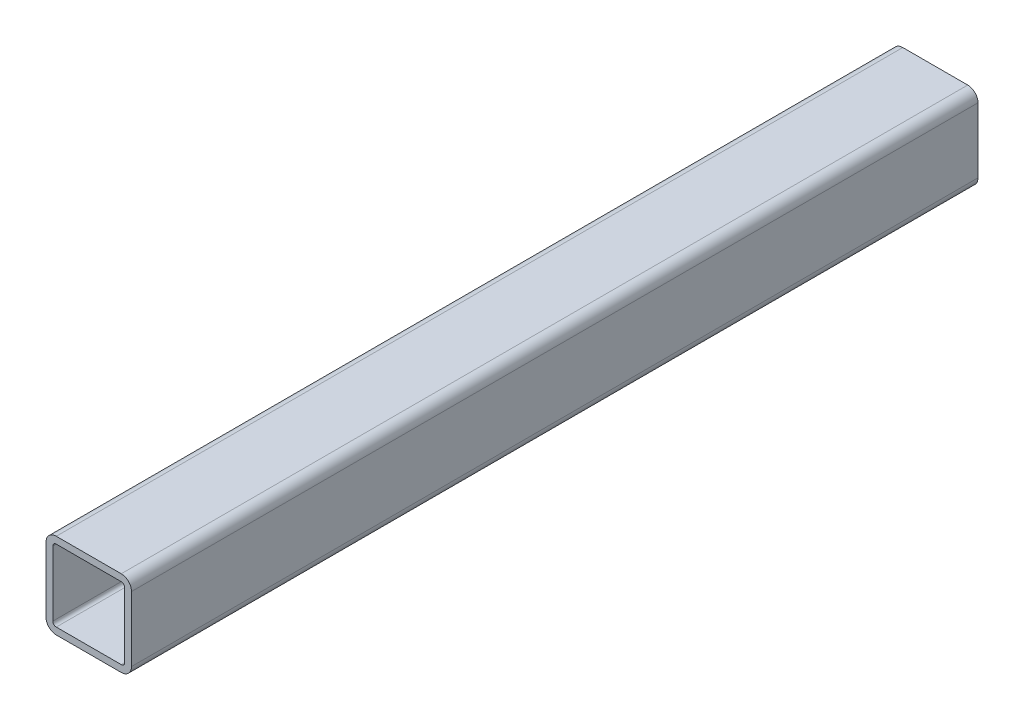
ISO-10303-21;
HEADER;
FILE_DESCRIPTION(('STEP AP214'),'2;1');
FILE_NAME('part.step','',(''),(''),'','','');
FILE_SCHEMA(('AUTOMOTIVE_DESIGN { 1 0 10303 214 1 1 1 1 }'));
ENDSEC;
DATA;
#1=APPLICATION_CONTEXT('core data for automotive mechanical design processes');
#2=APPLICATION_PROTOCOL_DEFINITION('international standard','automotive_design',2000,#1);
#3=PRODUCT_CONTEXT('',#1,'mechanical');
#4=PRODUCT('Part','Part','',(#3));
#5=PRODUCT_RELATED_PRODUCT_CATEGORY('part','',(#4));
#6=PRODUCT_DEFINITION_FORMATION('','',#4);
#7=PRODUCT_DEFINITION_CONTEXT('part definition',#1,'design');
#8=PRODUCT_DEFINITION('design','',#6,#7);
#9=PRODUCT_DEFINITION_SHAPE('','',#8);
#10=(LENGTH_UNIT() NAMED_UNIT(*) SI_UNIT(.MILLI.,.METRE.));
#11=(NAMED_UNIT(*) PLANE_ANGLE_UNIT() SI_UNIT($,.RADIAN.));
#12=(NAMED_UNIT(*) SI_UNIT($,.STERADIAN.) SOLID_ANGLE_UNIT());
#13=UNCERTAINTY_MEASURE_WITH_UNIT(LENGTH_MEASURE(1.E-05),#10,'distance_accuracy_value','');
#14=(GEOMETRIC_REPRESENTATION_CONTEXT(3) GLOBAL_UNCERTAINTY_ASSIGNED_CONTEXT((#13)) GLOBAL_UNIT_ASSIGNED_CONTEXT((#10,
#11,#12)) REPRESENTATION_CONTEXT('',''));
#15=CARTESIAN_POINT('',(0.,0.,0.));
#16=DIRECTION('',(0.,0.,1.));
#17=DIRECTION('',(1.,0.,0.));
#18=AXIS2_PLACEMENT_3D('',#15,#16,#17);
#19=CARTESIAN_POINT('',(0.,0.,247.5));
#20=DIRECTION('',(0.,0.,1.));
#21=DIRECTION('',(1.,0.,0.));
#22=AXIS2_PLACEMENT_3D('',#19,#20,#21);
#23=PLANE('',#22);
#24=DIRECTION('',(0.,1.,0.));
#25=VECTOR('',#24,1.);
#26=CARTESIAN_POINT('',(-12.5,-4.75,247.5));
#27=LINE('',#26,#25);
#28=CARTESIAN_POINT('',(-12.5,-9.5,247.5));
#29=VERTEX_POINT('',#28);
#30=CARTESIAN_POINT('',(-12.5,9.5,247.5));
#31=VERTEX_POINT('',#30);
#32=EDGE_CURVE('E128',#29,#31,#27,.T.);
#33=ORIENTED_EDGE('',*,*,#32,.F.);
#34=CARTESIAN_POINT('',(-9.5,-9.5,247.5));
#35=DIRECTION('',(0.,0.,-1.));
#36=DIRECTION('',(1.,0.,0.));
#37=AXIS2_PLACEMENT_3D('',#34,#35,#36);
#38=CIRCLE('',#37,3.);
#39=CARTESIAN_POINT('',(-9.5,-12.5,247.5));
#40=VERTEX_POINT('',#39);
#41=EDGE_CURVE('E160',#40,#29,#38,.T.);
#42=ORIENTED_EDGE('',*,*,#41,.F.);
#43=DIRECTION('',(-1.,0.,0.));
#44=VECTOR('',#43,1.);
#45=CARTESIAN_POINT('',(4.75,-12.5,247.5));
#46=LINE('',#45,#44);
#47=CARTESIAN_POINT('',(9.5,-12.5,247.5));
#48=VERTEX_POINT('',#47);
#49=EDGE_CURVE('E224',#48,#40,#46,.T.);
#50=ORIENTED_EDGE('',*,*,#49,.F.);
#51=CARTESIAN_POINT('',(9.5,-9.5,247.5));
#52=DIRECTION('',(0.,0.,-1.));
#53=DIRECTION('',(0.,1.,0.));
#54=AXIS2_PLACEMENT_3D('',#51,#52,#53);
#55=CIRCLE('',#54,3.);
#56=CARTESIAN_POINT('',(12.5,-9.5,247.5));
#57=VERTEX_POINT('',#56);
#58=EDGE_CURVE('E242',#57,#48,#55,.T.);
#59=ORIENTED_EDGE('',*,*,#58,.F.);
#60=DIRECTION('',(0.,-1.,0.));
#61=VECTOR('',#60,1.);
#62=CARTESIAN_POINT('',(12.5,4.75,247.5));
#63=LINE('',#62,#61);
#64=CARTESIAN_POINT('',(12.5,9.5,247.5));
#65=VERTEX_POINT('',#64);
#66=EDGE_CURVE('E299',#65,#57,#63,.T.);
#67=ORIENTED_EDGE('',*,*,#66,.F.);
#68=CARTESIAN_POINT('',(9.5,9.5,247.5));
#69=DIRECTION('',(0.,0.,-1.));
#70=DIRECTION('',(-1.,0.,0.));
#71=AXIS2_PLACEMENT_3D('',#68,#69,#70);
#72=CIRCLE('',#71,3.);
#73=CARTESIAN_POINT('',(9.5,12.5,247.5));
#74=VERTEX_POINT('',#73);
#75=EDGE_CURVE('E27',#74,#65,#72,.T.);
#76=ORIENTED_EDGE('',*,*,#75,.F.);
#77=DIRECTION('',(1.,0.,0.));
#78=VECTOR('',#77,1.);
#79=CARTESIAN_POINT('',(-4.75,12.5,247.5));
#80=LINE('',#79,#78);
#81=CARTESIAN_POINT('',(-9.5,12.5,247.5));
#82=VERTEX_POINT('',#81);
#83=EDGE_CURVE('E262',#82,#74,#80,.T.);
#84=ORIENTED_EDGE('',*,*,#83,.F.);
#85=CARTESIAN_POINT('',(-9.5,9.5,247.5));
#86=DIRECTION('',(0.,0.,-1.));
#87=DIRECTION('',(0.,-1.,0.));
#88=AXIS2_PLACEMENT_3D('',#85,#86,#87);
#89=CIRCLE('',#88,3.);
#90=EDGE_CURVE('E258',#31,#82,#89,.T.);
#91=ORIENTED_EDGE('',*,*,#90,.F.);
#92=EDGE_LOOP('',(#33,#42,#50,#59,#67,#76,#84,#91));
#93=FACE_BOUND('',#92,.T.);
#94=DIRECTION('',(-1.,0.,0.));
#95=VECTOR('',#94,1.);
#96=CARTESIAN_POINT('',(-4.75,10.5,247.5));
#97=LINE('',#96,#95);
#98=CARTESIAN_POINT('',(9.5,10.5,247.5));
#99=VERTEX_POINT('',#98);
#100=CARTESIAN_POINT('',(-9.5,10.5,247.5));
#101=VERTEX_POINT('',#100);
#102=EDGE_CURVE('E143',#99,#101,#97,.T.);
#103=ORIENTED_EDGE('',*,*,#102,.F.);
#104=CARTESIAN_POINT('',(9.5,9.5,247.5));
#105=DIRECTION('',(0.,0.,1.));
#106=DIRECTION('',(-1.,0.,0.));
#107=AXIS2_PLACEMENT_3D('',#104,#105,#106);
#108=CIRCLE('',#107,1.);
#109=CARTESIAN_POINT('',(10.5,9.5,247.5));
#110=VERTEX_POINT('',#109);
#111=EDGE_CURVE('E170',#110,#99,#108,.T.);
#112=ORIENTED_EDGE('',*,*,#111,.F.);
#113=DIRECTION('',(0.,1.,0.));
#114=VECTOR('',#113,1.);
#115=CARTESIAN_POINT('',(10.5,4.75,247.5));
#116=LINE('',#115,#114);
#117=CARTESIAN_POINT('',(10.5,-9.5,247.5));
#118=VERTEX_POINT('',#117);
#119=EDGE_CURVE('E169',#118,#110,#116,.T.);
#120=ORIENTED_EDGE('',*,*,#119,.F.);
#121=CARTESIAN_POINT('',(9.5,-9.5,247.5));
#122=DIRECTION('',(0.,0.,1.));
#123=DIRECTION('',(0.,1.,0.));
#124=AXIS2_PLACEMENT_3D('',#121,#122,#123);
#125=CIRCLE('',#124,1.);
#126=CARTESIAN_POINT('',(9.5,-10.5,247.5));
#127=VERTEX_POINT('',#126);
#128=EDGE_CURVE('E180',#127,#118,#125,.T.);
#129=ORIENTED_EDGE('',*,*,#128,.F.);
#130=DIRECTION('',(1.,0.,0.));
#131=VECTOR('',#130,1.);
#132=CARTESIAN_POINT('',(4.75,-10.5,247.5));
#133=LINE('',#132,#131);
#134=CARTESIAN_POINT('',(-9.5,-10.5,247.5));
#135=VERTEX_POINT('',#134);
#136=EDGE_CURVE('E216',#135,#127,#133,.T.);
#137=ORIENTED_EDGE('',*,*,#136,.F.);
#138=CARTESIAN_POINT('',(-9.5,-9.5,247.5));
#139=DIRECTION('',(0.,0.,1.));
#140=DIRECTION('',(1.,0.,0.));
#141=AXIS2_PLACEMENT_3D('',#138,#139,#140);
#142=CIRCLE('',#141,1.);
#143=CARTESIAN_POINT('',(-10.5,-9.5,247.5));
#144=VERTEX_POINT('',#143);
#145=EDGE_CURVE('E140',#144,#135,#142,.T.);
#146=ORIENTED_EDGE('',*,*,#145,.F.);
#147=DIRECTION('',(0.,-1.,0.));
#148=VECTOR('',#147,1.);
#149=CARTESIAN_POINT('',(-10.5,-4.75,247.5));
#150=LINE('',#149,#148);
#151=CARTESIAN_POINT('',(-10.5,9.5,247.5));
#152=VERTEX_POINT('',#151);
#153=EDGE_CURVE('E193',#152,#144,#150,.T.);
#154=ORIENTED_EDGE('',*,*,#153,.F.);
#155=CARTESIAN_POINT('',(-9.5,9.5,247.5));
#156=DIRECTION('',(0.,0.,1.));
#157=DIRECTION('',(0.,-1.,0.));
#158=AXIS2_PLACEMENT_3D('',#155,#156,#157);
#159=CIRCLE('',#158,1.);
#160=EDGE_CURVE('E129',#101,#152,#159,.T.);
#161=ORIENTED_EDGE('',*,*,#160,.F.);
#162=EDGE_LOOP('',(#103,#112,#120,#129,#137,#146,#154,#161));
#163=FACE_BOUND('',#162,.T.);
#164=ADVANCED_FACE('F16',(#93,#163),#23,.T.);
#165=CARTESIAN_POINT('',(0.,0.,0.));
#166=DIRECTION('',(0.,0.,1.));
#167=DIRECTION('',(1.,0.,0.));
#168=AXIS2_PLACEMENT_3D('',#165,#166,#167);
#169=PLANE('',#168);
#170=DIRECTION('',(0.,1.,0.));
#171=VECTOR('',#170,1.);
#172=CARTESIAN_POINT('',(-12.5,-4.75,0.));
#173=LINE('',#172,#171);
#174=CARTESIAN_POINT('',(-12.5,-9.5,0.));
#175=VERTEX_POINT('',#174);
#176=CARTESIAN_POINT('',(-12.5,9.5,0.));
#177=VERTEX_POINT('',#176);
#178=EDGE_CURVE('E20',#175,#177,#173,.T.);
#179=ORIENTED_EDGE('',*,*,#178,.T.);
#180=CARTESIAN_POINT('',(-9.5,9.5,0.));
#181=DIRECTION('',(0.,0.,-1.));
#182=DIRECTION('',(0.,-1.,0.));
#183=AXIS2_PLACEMENT_3D('',#180,#181,#182);
#184=CIRCLE('',#183,3.);
#185=CARTESIAN_POINT('',(-9.5,12.5,0.));
#186=VERTEX_POINT('',#185);
#187=EDGE_CURVE('E257',#177,#186,#184,.T.);
#188=ORIENTED_EDGE('',*,*,#187,.T.);
#189=DIRECTION('',(1.,0.,0.));
#190=VECTOR('',#189,1.);
#191=CARTESIAN_POINT('',(-4.75,12.5,0.));
#192=LINE('',#191,#190);
#193=CARTESIAN_POINT('',(9.5,12.5,0.));
#194=VERTEX_POINT('',#193);
#195=EDGE_CURVE('E163',#186,#194,#192,.T.);
#196=ORIENTED_EDGE('',*,*,#195,.T.);
#197=CARTESIAN_POINT('',(9.5,9.5,0.));
#198=DIRECTION('',(0.,0.,-1.));
#199=DIRECTION('',(-1.,0.,0.));
#200=AXIS2_PLACEMENT_3D('',#197,#198,#199);
#201=CIRCLE('',#200,3.);
#202=CARTESIAN_POINT('',(12.5,9.5,0.));
#203=VERTEX_POINT('',#202);
#204=EDGE_CURVE('E11',#194,#203,#201,.T.);
#205=ORIENTED_EDGE('',*,*,#204,.T.);
#206=DIRECTION('',(0.,-1.,0.));
#207=VECTOR('',#206,1.);
#208=CARTESIAN_POINT('',(12.5,4.75,0.));
#209=LINE('',#208,#207);
#210=CARTESIAN_POINT('',(12.5,-9.5,0.));
#211=VERTEX_POINT('',#210);
#212=EDGE_CURVE('E230',#203,#211,#209,.T.);
#213=ORIENTED_EDGE('',*,*,#212,.T.);
#214=CARTESIAN_POINT('',(9.5,-9.5,0.));
#215=DIRECTION('',(0.,0.,-1.));
#216=DIRECTION('',(0.,1.,0.));
#217=AXIS2_PLACEMENT_3D('',#214,#215,#216);
#218=CIRCLE('',#217,3.);
#219=CARTESIAN_POINT('',(9.5,-12.5,0.));
#220=VERTEX_POINT('',#219);
#221=EDGE_CURVE('E229',#211,#220,#218,.T.);
#222=ORIENTED_EDGE('',*,*,#221,.T.);
#223=DIRECTION('',(-1.,0.,0.));
#224=VECTOR('',#223,1.);
#225=CARTESIAN_POINT('',(4.75,-12.5,0.));
#226=LINE('',#225,#224);
#227=CARTESIAN_POINT('',(-9.5,-12.5,0.));
#228=VERTEX_POINT('',#227);
#229=EDGE_CURVE('E241',#220,#228,#226,.T.);
#230=ORIENTED_EDGE('',*,*,#229,.T.);
#231=CARTESIAN_POINT('',(-9.5,-9.5,0.));
#232=DIRECTION('',(0.,0.,-1.));
#233=DIRECTION('',(1.,0.,0.));
#234=AXIS2_PLACEMENT_3D('',#231,#232,#233);
#235=CIRCLE('',#234,3.);
#236=EDGE_CURVE('E150',#228,#175,#235,.T.);
#237=ORIENTED_EDGE('',*,*,#236,.T.);
#238=EDGE_LOOP('',(#179,#188,#196,#205,#213,#222,#230,#237));
#239=FACE_BOUND('',#238,.T.);
#240=DIRECTION('',(-1.,0.,0.));
#241=VECTOR('',#240,1.);
#242=CARTESIAN_POINT('',(-4.75,10.5,0.));
#243=LINE('',#242,#241);
#244=CARTESIAN_POINT('',(9.5,10.5,0.));
#245=VERTEX_POINT('',#244);
#246=CARTESIAN_POINT('',(-9.5,10.5,0.));
#247=VERTEX_POINT('',#246);
#248=EDGE_CURVE('E132',#245,#247,#243,.T.);
#249=ORIENTED_EDGE('',*,*,#248,.T.);
#250=CARTESIAN_POINT('',(-9.5,9.5,0.));
#251=DIRECTION('',(0.,0.,1.));
#252=DIRECTION('',(0.,-1.,0.));
#253=AXIS2_PLACEMENT_3D('',#250,#251,#252);
#254=CIRCLE('',#253,1.);
#255=CARTESIAN_POINT('',(-10.5,9.5,0.));
#256=VERTEX_POINT('',#255);
#257=EDGE_CURVE('E115',#247,#256,#254,.T.);
#258=ORIENTED_EDGE('',*,*,#257,.T.);
#259=DIRECTION('',(0.,-1.,0.));
#260=VECTOR('',#259,1.);
#261=CARTESIAN_POINT('',(-10.5,-4.75,0.));
#262=LINE('',#261,#260);
#263=CARTESIAN_POINT('',(-10.5,-9.5,0.));
#264=VERTEX_POINT('',#263);
#265=EDGE_CURVE('E195',#256,#264,#262,.T.);
#266=ORIENTED_EDGE('',*,*,#265,.T.);
#267=CARTESIAN_POINT('',(-9.5,-9.5,0.));
#268=DIRECTION('',(0.,0.,1.));
#269=DIRECTION('',(1.,0.,0.));
#270=AXIS2_PLACEMENT_3D('',#267,#268,#269);
#271=CIRCLE('',#270,1.);
#272=CARTESIAN_POINT('',(-9.5,-10.5,0.));
#273=VERTEX_POINT('',#272);
#274=EDGE_CURVE('E194',#264,#273,#271,.T.);
#275=ORIENTED_EDGE('',*,*,#274,.T.);
#276=DIRECTION('',(1.,0.,0.));
#277=VECTOR('',#276,1.);
#278=CARTESIAN_POINT('',(4.75,-10.5,0.));
#279=LINE('',#278,#277);
#280=CARTESIAN_POINT('',(9.5,-10.5,0.));
#281=VERTEX_POINT('',#280);
#282=EDGE_CURVE('E185',#273,#281,#279,.T.);
#283=ORIENTED_EDGE('',*,*,#282,.T.);
#284=CARTESIAN_POINT('',(9.5,-9.5,0.));
#285=DIRECTION('',(0.,0.,1.));
#286=DIRECTION('',(0.,1.,0.));
#287=AXIS2_PLACEMENT_3D('',#284,#285,#286);
#288=CIRCLE('',#287,1.);
#289=CARTESIAN_POINT('',(10.5,-9.5,0.));
#290=VERTEX_POINT('',#289);
#291=EDGE_CURVE('E179',#281,#290,#288,.T.);
#292=ORIENTED_EDGE('',*,*,#291,.T.);
#293=DIRECTION('',(0.,1.,0.));
#294=VECTOR('',#293,1.);
#295=CARTESIAN_POINT('',(10.5,4.75,0.));
#296=LINE('',#295,#294);
#297=CARTESIAN_POINT('',(10.5,9.5,0.));
#298=VERTEX_POINT('',#297);
#299=EDGE_CURVE('E168',#290,#298,#296,.T.);
#300=ORIENTED_EDGE('',*,*,#299,.T.);
#301=CARTESIAN_POINT('',(9.5,9.5,0.));
#302=DIRECTION('',(0.,0.,1.));
#303=DIRECTION('',(-1.,0.,0.));
#304=AXIS2_PLACEMENT_3D('',#301,#302,#303);
#305=CIRCLE('',#304,1.);
#306=EDGE_CURVE('E135',#298,#245,#305,.T.);
#307=ORIENTED_EDGE('',*,*,#306,.T.);
#308=EDGE_LOOP('',(#249,#258,#266,#275,#283,#292,#300,#307));
#309=FACE_BOUND('',#308,.T.);
#310=ADVANCED_FACE('F18',(#239,#309),#169,.F.);
#311=CARTESIAN_POINT('',(9.5,9.5,0.));
#312=DIRECTION('',(0.,0.,1.));
#313=DIRECTION('',(-1.,0.,0.));
#314=AXIS2_PLACEMENT_3D('',#311,#312,#313);
#315=CYLINDRICAL_SURFACE('',#314,3.);
#316=ORIENTED_EDGE('',*,*,#75,.T.);
#317=DIRECTION('',(0.,0.,1.));
#318=VECTOR('',#317,1.);
#319=CARTESIAN_POINT('',(12.5,9.5,0.));
#320=LINE('',#319,#318);
#321=EDGE_CURVE('E234',#203,#65,#320,.T.);
#322=ORIENTED_EDGE('',*,*,#321,.F.);
#323=ORIENTED_EDGE('',*,*,#204,.F.);
#324=DIRECTION('',(0.,0.,1.));
#325=VECTOR('',#324,1.);
#326=CARTESIAN_POINT('',(9.5,12.5,0.));
#327=LINE('',#326,#325);
#328=EDGE_CURVE('E263',#194,#74,#327,.T.);
#329=ORIENTED_EDGE('',*,*,#328,.T.);
#330=EDGE_LOOP('',(#316,#322,#323,#329));
#331=FACE_BOUND('',#330,.T.);
#332=ADVANCED_FACE('F519',(#331),#315,.T.);
#333=CARTESIAN_POINT('',(-9.5,12.5,0.));
#334=DIRECTION('',(0.,1.,0.));
#335=DIRECTION('',(1.,0.,0.));
#336=AXIS2_PLACEMENT_3D('',#333,#334,#335);
#337=PLANE('',#336);
#338=ORIENTED_EDGE('',*,*,#83,.T.);
#339=ORIENTED_EDGE('',*,*,#328,.F.);
#340=ORIENTED_EDGE('',*,*,#195,.F.);
#341=DIRECTION('',(0.,0.,1.));
#342=VECTOR('',#341,1.);
#343=CARTESIAN_POINT('',(-9.5,12.5,0.));
#344=LINE('',#343,#342);
#345=EDGE_CURVE('E253',#186,#82,#344,.T.);
#346=ORIENTED_EDGE('',*,*,#345,.T.);
#347=EDGE_LOOP('',(#338,#339,#340,#346));
#348=FACE_BOUND('',#347,.T.);
#349=ADVANCED_FACE('F514',(#348),#337,.T.);
#350=CARTESIAN_POINT('',(-9.5,9.5,0.));
#351=DIRECTION('',(0.,0.,1.));
#352=DIRECTION('',(0.,-1.,0.));
#353=AXIS2_PLACEMENT_3D('',#350,#351,#352);
#354=CYLINDRICAL_SURFACE('',#353,3.);
#355=ORIENTED_EDGE('',*,*,#90,.T.);
#356=ORIENTED_EDGE('',*,*,#345,.F.);
#357=ORIENTED_EDGE('',*,*,#187,.F.);
#358=DIRECTION('',(0.,0.,1.));
#359=VECTOR('',#358,1.);
#360=CARTESIAN_POINT('',(-12.5,9.5,0.));
#361=LINE('',#360,#359);
#362=EDGE_CURVE('E212',#177,#31,#361,.T.);
#363=ORIENTED_EDGE('',*,*,#362,.T.);
#364=EDGE_LOOP('',(#355,#356,#357,#363));
#365=FACE_BOUND('',#364,.T.);
#366=ADVANCED_FACE('F509',(#365),#354,.T.);
#367=CARTESIAN_POINT('',(-12.5,-9.5,0.));
#368=DIRECTION('',(-1.,0.,0.));
#369=DIRECTION('',(0.,1.,0.));
#370=AXIS2_PLACEMENT_3D('',#367,#368,#369);
#371=PLANE('',#370);
#372=ORIENTED_EDGE('',*,*,#32,.T.);
#373=ORIENTED_EDGE('',*,*,#362,.F.);
#374=ORIENTED_EDGE('',*,*,#178,.F.);
#375=DIRECTION('',(0.,0.,1.));
#376=VECTOR('',#375,1.);
#377=CARTESIAN_POINT('',(-12.5,-9.5,0.));
#378=LINE('',#377,#376);
#379=EDGE_CURVE('E156',#175,#29,#378,.T.);
#380=ORIENTED_EDGE('',*,*,#379,.T.);
#381=EDGE_LOOP('',(#372,#373,#374,#380));
#382=FACE_BOUND('',#381,.T.);
#383=ADVANCED_FACE('F405',(#382),#371,.T.);
#384=CARTESIAN_POINT('',(-9.5,9.5,0.));
#385=DIRECTION('',(0.,0.,1.));
#386=DIRECTION('',(0.,-1.,0.));
#387=AXIS2_PLACEMENT_3D('',#384,#385,#386);
#388=CYLINDRICAL_SURFACE('',#387,1.);
#389=ORIENTED_EDGE('',*,*,#160,.T.);
#390=DIRECTION('',(0.,0.,1.));
#391=VECTOR('',#390,1.);
#392=CARTESIAN_POINT('',(-10.5,9.5,0.));
#393=LINE('',#392,#391);
#394=EDGE_CURVE('E123',#256,#152,#393,.T.);
#395=ORIENTED_EDGE('',*,*,#394,.F.);
#396=ORIENTED_EDGE('',*,*,#257,.F.);
#397=DIRECTION('',(0.,0.,1.));
#398=VECTOR('',#397,1.);
#399=CARTESIAN_POINT('',(-9.5,10.5,0.));
#400=LINE('',#399,#398);
#401=EDGE_CURVE('E120',#247,#101,#400,.T.);
#402=ORIENTED_EDGE('',*,*,#401,.T.);
#403=EDGE_LOOP('',(#389,#395,#396,#402));
#404=FACE_BOUND('',#403,.T.);
#405=ADVANCED_FACE('F118',(#404),#388,.F.);
#406=CARTESIAN_POINT('',(-10.5,-9.5,0.));
#407=DIRECTION('',(-1.,0.,0.));
#408=DIRECTION('',(0.,0.,1.));
#409=AXIS2_PLACEMENT_3D('',#406,#407,#408);
#410=PLANE('',#409);
#411=ORIENTED_EDGE('',*,*,#153,.T.);
#412=DIRECTION('',(0.,0.,1.));
#413=VECTOR('',#412,1.);
#414=CARTESIAN_POINT('',(-10.5,-9.5,0.));
#415=LINE('',#414,#413);
#416=EDGE_CURVE('E189',#264,#144,#415,.T.);
#417=ORIENTED_EDGE('',*,*,#416,.F.);
#418=ORIENTED_EDGE('',*,*,#265,.F.);
#419=ORIENTED_EDGE('',*,*,#394,.T.);
#420=EDGE_LOOP('',(#411,#417,#418,#419));
#421=FACE_BOUND('',#420,.T.);
#422=ADVANCED_FACE('F492',(#421),#410,.F.);
#423=CARTESIAN_POINT('',(-9.5,-9.5,0.));
#424=DIRECTION('',(0.,0.,1.));
#425=DIRECTION('',(1.,0.,0.));
#426=AXIS2_PLACEMENT_3D('',#423,#424,#425);
#427=CYLINDRICAL_SURFACE('',#426,1.);
#428=ORIENTED_EDGE('',*,*,#145,.T.);
#429=DIRECTION('',(0.,0.,1.));
#430=VECTOR('',#429,1.);
#431=CARTESIAN_POINT('',(-9.5,-10.5,0.));
#432=LINE('',#431,#430);
#433=EDGE_CURVE('E181',#273,#135,#432,.T.);
#434=ORIENTED_EDGE('',*,*,#433,.F.);
#435=ORIENTED_EDGE('',*,*,#274,.F.);
#436=ORIENTED_EDGE('',*,*,#416,.T.);
#437=EDGE_LOOP('',(#428,#434,#435,#436));
#438=FACE_BOUND('',#437,.T.);
#439=ADVANCED_FACE('F308',(#438),#427,.F.);
#440=CARTESIAN_POINT('',(-9.5,10.5,0.));
#441=DIRECTION('',(0.,1.,0.));
#442=DIRECTION('',(1.,0.,0.));
#443=AXIS2_PLACEMENT_3D('',#440,#441,#442);
#444=PLANE('',#443);
#445=ORIENTED_EDGE('',*,*,#102,.T.);
#446=ORIENTED_EDGE('',*,*,#401,.F.);
#447=ORIENTED_EDGE('',*,*,#248,.F.);
#448=DIRECTION('',(0.,0.,1.));
#449=VECTOR('',#448,1.);
#450=CARTESIAN_POINT('',(9.5,10.5,0.));
#451=LINE('',#450,#449);
#452=EDGE_CURVE('E174',#245,#99,#451,.T.);
#453=ORIENTED_EDGE('',*,*,#452,.T.);
#454=EDGE_LOOP('',(#445,#446,#447,#453));
#455=FACE_BOUND('',#454,.T.);
#456=ADVANCED_FACE('F142',(#455),#444,.F.);
#457=CARTESIAN_POINT('',(-9.5,-9.5,0.));
#458=DIRECTION('',(0.,0.,1.));
#459=DIRECTION('',(1.,0.,0.));
#460=AXIS2_PLACEMENT_3D('',#457,#458,#459);
#461=CYLINDRICAL_SURFACE('',#460,3.);
#462=ORIENTED_EDGE('',*,*,#41,.T.);
#463=ORIENTED_EDGE('',*,*,#379,.F.);
#464=ORIENTED_EDGE('',*,*,#236,.F.);
#465=DIRECTION('',(0.,0.,1.));
#466=VECTOR('',#465,1.);
#467=CARTESIAN_POINT('',(-9.5,-12.5,0.));
#468=LINE('',#467,#466);
#469=EDGE_CURVE('E228',#228,#40,#468,.T.);
#470=ORIENTED_EDGE('',*,*,#469,.T.);
#471=EDGE_LOOP('',(#462,#463,#464,#470));
#472=FACE_BOUND('',#471,.T.);
#473=ADVANCED_FACE('F403',(#472),#461,.T.);
#474=CARTESIAN_POINT('',(9.5,-12.5,0.));
#475=DIRECTION('',(0.,-1.,0.));
#476=DIRECTION('',(0.,0.,-1.));
#477=AXIS2_PLACEMENT_3D('',#474,#475,#476);
#478=PLANE('',#477);
#479=ORIENTED_EDGE('',*,*,#49,.T.);
#480=ORIENTED_EDGE('',*,*,#469,.F.);
#481=ORIENTED_EDGE('',*,*,#229,.F.);
#482=DIRECTION('',(0.,0.,1.));
#483=VECTOR('',#482,1.);
#484=CARTESIAN_POINT('',(9.5,-12.5,0.));
#485=LINE('',#484,#483);
#486=EDGE_CURVE('E245',#220,#48,#485,.T.);
#487=ORIENTED_EDGE('',*,*,#486,.T.);
#488=EDGE_LOOP('',(#479,#480,#481,#487));
#489=FACE_BOUND('',#488,.T.);
#490=ADVANCED_FACE('F402',(#489),#478,.T.);
#491=CARTESIAN_POINT('',(9.5,-9.5,0.));
#492=DIRECTION('',(0.,0.,1.));
#493=DIRECTION('',(0.,1.,0.));
#494=AXIS2_PLACEMENT_3D('',#491,#492,#493);
#495=CYLINDRICAL_SURFACE('',#494,3.);
#496=ORIENTED_EDGE('',*,*,#58,.T.);
#497=ORIENTED_EDGE('',*,*,#486,.F.);
#498=ORIENTED_EDGE('',*,*,#221,.F.);
#499=DIRECTION('',(0.,0.,1.));
#500=VECTOR('',#499,1.);
#501=CARTESIAN_POINT('',(12.5,-9.5,0.));
#502=LINE('',#501,#500);
#503=EDGE_CURVE('E154',#211,#57,#502,.T.);
#504=ORIENTED_EDGE('',*,*,#503,.T.);
#505=EDGE_LOOP('',(#496,#497,#498,#504));
#506=FACE_BOUND('',#505,.T.);
#507=ADVANCED_FACE('F378',(#506),#495,.T.);
#508=CARTESIAN_POINT('',(12.5,9.5,0.));
#509=DIRECTION('',(1.,0.,0.));
#510=DIRECTION('',(0.,1.,0.));
#511=AXIS2_PLACEMENT_3D('',#508,#509,#510);
#512=PLANE('',#511);
#513=ORIENTED_EDGE('',*,*,#66,.T.);
#514=ORIENTED_EDGE('',*,*,#503,.F.);
#515=ORIENTED_EDGE('',*,*,#212,.F.);
#516=ORIENTED_EDGE('',*,*,#321,.T.);
#517=EDGE_LOOP('',(#513,#514,#515,#516));
#518=FACE_BOUND('',#517,.T.);
#519=ADVANCED_FACE('F384',(#518),#512,.T.);
#520=CARTESIAN_POINT('',(9.5,9.5,0.));
#521=DIRECTION('',(0.,0.,1.));
#522=DIRECTION('',(-1.,0.,0.));
#523=AXIS2_PLACEMENT_3D('',#520,#521,#522);
#524=CYLINDRICAL_SURFACE('',#523,1.);
#525=ORIENTED_EDGE('',*,*,#111,.T.);
#526=ORIENTED_EDGE('',*,*,#452,.F.);
#527=ORIENTED_EDGE('',*,*,#306,.F.);
#528=DIRECTION('',(0.,0.,1.));
#529=VECTOR('',#528,1.);
#530=CARTESIAN_POINT('',(10.5,9.5,0.));
#531=LINE('',#530,#529);
#532=EDGE_CURVE('E164',#298,#110,#531,.T.);
#533=ORIENTED_EDGE('',*,*,#532,.T.);
#534=EDGE_LOOP('',(#525,#526,#527,#533));
#535=FACE_BOUND('',#534,.T.);
#536=ADVANCED_FACE('F563',(#535),#524,.F.);
#537=CARTESIAN_POINT('',(10.5,9.5,0.));
#538=DIRECTION('',(1.,0.,0.));
#539=DIRECTION('',(0.,-1.,0.));
#540=AXIS2_PLACEMENT_3D('',#537,#538,#539);
#541=PLANE('',#540);
#542=ORIENTED_EDGE('',*,*,#119,.T.);
#543=ORIENTED_EDGE('',*,*,#532,.F.);
#544=ORIENTED_EDGE('',*,*,#299,.F.);
#545=DIRECTION('',(0.,0.,1.));
#546=VECTOR('',#545,1.);
#547=CARTESIAN_POINT('',(10.5,-9.5,0.));
#548=LINE('',#547,#546);
#549=EDGE_CURVE('E175',#290,#118,#548,.T.);
#550=ORIENTED_EDGE('',*,*,#549,.T.);
#551=EDGE_LOOP('',(#542,#543,#544,#550));
#552=FACE_BOUND('',#551,.T.);
#553=ADVANCED_FACE('F486',(#552),#541,.F.);
#554=CARTESIAN_POINT('',(9.5,-9.5,0.));
#555=DIRECTION('',(0.,0.,1.));
#556=DIRECTION('',(0.,1.,0.));
#557=AXIS2_PLACEMENT_3D('',#554,#555,#556);
#558=CYLINDRICAL_SURFACE('',#557,1.);
#559=ORIENTED_EDGE('',*,*,#128,.T.);
#560=ORIENTED_EDGE('',*,*,#549,.F.);
#561=ORIENTED_EDGE('',*,*,#291,.F.);
#562=DIRECTION('',(0.,0.,1.));
#563=VECTOR('',#562,1.);
#564=CARTESIAN_POINT('',(9.5,-10.5,0.));
#565=LINE('',#564,#563);
#566=EDGE_CURVE('E220',#281,#127,#565,.T.);
#567=ORIENTED_EDGE('',*,*,#566,.T.);
#568=EDGE_LOOP('',(#559,#560,#561,#567));
#569=FACE_BOUND('',#568,.T.);
#570=ADVANCED_FACE('F325',(#569),#558,.F.);
#571=CARTESIAN_POINT('',(9.5,-10.5,0.));
#572=DIRECTION('',(0.,-1.,0.));
#573=DIRECTION('',(0.,0.,-1.));
#574=AXIS2_PLACEMENT_3D('',#571,#572,#573);
#575=PLANE('',#574);
#576=ORIENTED_EDGE('',*,*,#136,.T.);
#577=ORIENTED_EDGE('',*,*,#566,.F.);
#578=ORIENTED_EDGE('',*,*,#282,.F.);
#579=ORIENTED_EDGE('',*,*,#433,.T.);
#580=EDGE_LOOP('',(#576,#577,#578,#579));
#581=FACE_BOUND('',#580,.T.);
#582=ADVANCED_FACE('F315',(#581),#575,.F.);
#583=CLOSED_SHELL('',(#164,#310,#332,#349,#366,#383,#405,#422,#439,#456,#473,#490,#507,#519,
#536,#553,#570,#582));
#584=MANIFOLD_SOLID_BREP('B1',#583);
#585=ADVANCED_BREP_SHAPE_REPRESENTATION('',(#18,#584),#14);
#586=SHAPE_DEFINITION_REPRESENTATION(#9,#585);
ENDSEC;
END-ISO-10303-21;
